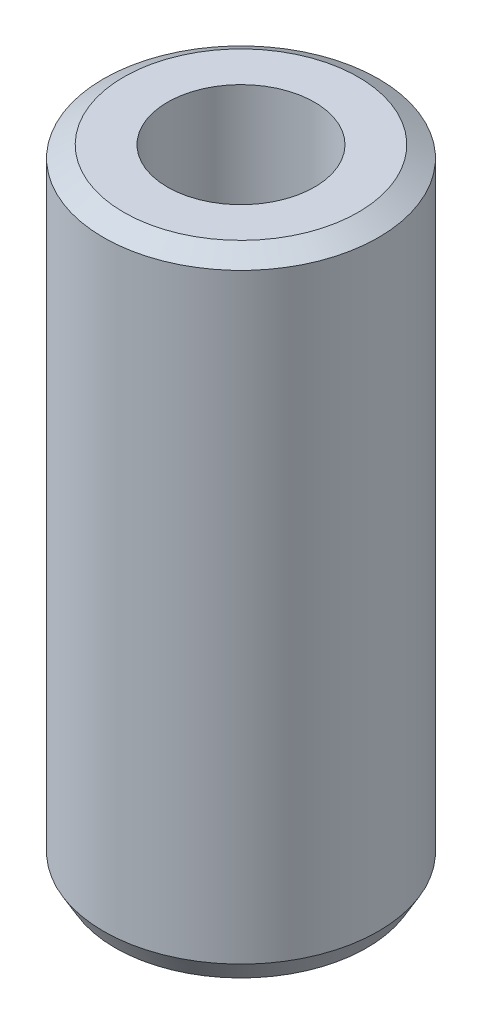
ISO-10303-21;
HEADER;
FILE_DESCRIPTION(('STEP AP214'),'2;1');
FILE_NAME('part.step','',(''),(''),'','','');
FILE_SCHEMA(('AUTOMOTIVE_DESIGN { 1 0 10303 214 1 1 1 1 }'));
ENDSEC;
DATA;
#1=APPLICATION_CONTEXT('core data for automotive mechanical design processes');
#2=APPLICATION_PROTOCOL_DEFINITION('international standard','automotive_design',2000,#1);
#3=PRODUCT_CONTEXT('',#1,'mechanical');
#4=PRODUCT('Part','Part','',(#3));
#5=PRODUCT_RELATED_PRODUCT_CATEGORY('part','',(#4));
#6=PRODUCT_DEFINITION_FORMATION('','',#4);
#7=PRODUCT_DEFINITION_CONTEXT('part definition',#1,'design');
#8=PRODUCT_DEFINITION('design','',#6,#7);
#9=PRODUCT_DEFINITION_SHAPE('','',#8);
#10=(LENGTH_UNIT() NAMED_UNIT(*) SI_UNIT(.MILLI.,.METRE.));
#11=(NAMED_UNIT(*) PLANE_ANGLE_UNIT() SI_UNIT($,.RADIAN.));
#12=(NAMED_UNIT(*) SI_UNIT($,.STERADIAN.) SOLID_ANGLE_UNIT());
#13=UNCERTAINTY_MEASURE_WITH_UNIT(LENGTH_MEASURE(1.E-05),#10,'distance_accuracy_value','');
#14=(GEOMETRIC_REPRESENTATION_CONTEXT(3) GLOBAL_UNCERTAINTY_ASSIGNED_CONTEXT((#13)) GLOBAL_UNIT_ASSIGNED_CONTEXT((#10,
#11,#12)) REPRESENTATION_CONTEXT('',''));
#15=CARTESIAN_POINT('',(0.,0.,0.));
#16=DIRECTION('',(0.,0.,1.));
#17=DIRECTION('',(1.,0.,0.));
#18=AXIS2_PLACEMENT_3D('',#15,#16,#17);
#19=CARTESIAN_POINT('',(0.,126.547188051281,0.));
#20=DIRECTION('',(0.,-1.,0.));
#21=DIRECTION('',(0.,0.,-1.));
#22=AXIS2_PLACEMENT_3D('',#19,#20,#21);
#23=CYLINDRICAL_SURFACE('',#22,27.5);
#24=CARTESIAN_POINT('',(0.,124.20850997424,0.));
#25=DIRECTION('',(0.,1.,0.));
#26=DIRECTION('',(0.,0.,1.));
#27=AXIS2_PLACEMENT_3D('',#24,#25,#26);
#28=CIRCLE('',#27,27.5);
#29=CARTESIAN_POINT('',(0.,124.20850997424,27.5));
#30=VERTEX_POINT('',#29);
#31=EDGE_CURVE('E50',#30,#30,#28,.F.);
#32=ORIENTED_EDGE('',*,*,#31,.T.);
#33=EDGE_LOOP('',(#32));
#34=FACE_BOUND('',#33,.T.);
#35=CARTESIAN_POINT('',(0.,4.05070925198237,0.));
#36=DIRECTION('',(0.,1.,0.));
#37=DIRECTION('',(0.,0.,1.));
#38=AXIS2_PLACEMENT_3D('',#35,#36,#37);
#39=CIRCLE('',#38,27.5);
#40=CARTESIAN_POINT('',(0.,4.05070925198237,27.5));
#41=VERTEX_POINT('',#40);
#42=EDGE_CURVE('E51',#41,#41,#39,.T.);
#43=ORIENTED_EDGE('',*,*,#42,.T.);
#44=EDGE_LOOP('',(#43));
#45=FACE_BOUND('',#44,.T.);
#46=ADVANCED_FACE('F39',(#34,#45),#23,.T.);
#47=CARTESIAN_POINT('',(0.,126.547188051281,0.));
#48=DIRECTION('',(0.,1.,0.));
#49=DIRECTION('',(0.,0.,1.));
#50=AXIS2_PLACEMENT_3D('',#47,#48,#49);
#51=PLANE('',#50);
#52=CARTESIAN_POINT('',(0.,126.547188051281,0.));
#53=DIRECTION('',(0.,1.,0.));
#54=DIRECTION('',(0.,0.,1.));
#55=AXIS2_PLACEMENT_3D('',#52,#53,#54);
#56=CIRCLE('',#55,23.4492907480176);
#57=CARTESIAN_POINT('',(0.,126.547188051281,23.4492907480176));
#58=VERTEX_POINT('',#57);
#59=EDGE_CURVE('E54',#58,#58,#56,.T.);
#60=ORIENTED_EDGE('',*,*,#59,.T.);
#61=EDGE_LOOP('',(#60));
#62=FACE_BOUND('',#61,.T.);
#63=CARTESIAN_POINT('',(0.,126.547188051281,0.));
#64=DIRECTION('',(0.,1.,0.));
#65=DIRECTION('',(0.,0.,1.));
#66=AXIS2_PLACEMENT_3D('',#63,#64,#65);
#67=CIRCLE('',#66,14.7146600426307);
#68=CARTESIAN_POINT('',(0.,126.547188051281,14.7146600426307));
#69=VERTEX_POINT('',#68);
#70=EDGE_CURVE('E58',#69,#69,#67,.T.);
#71=ORIENTED_EDGE('',*,*,#70,.F.);
#72=EDGE_LOOP('',(#71));
#73=FACE_BOUND('',#72,.T.);
#74=ADVANCED_FACE('F69',(#62,#73),#51,.T.);
#75=CARTESIAN_POINT('',(0.,0.,0.));
#76=DIRECTION('',(0.,1.,0.));
#77=DIRECTION('',(0.,0.,1.));
#78=AXIS2_PLACEMENT_3D('',#75,#76,#77);
#79=PLANE('',#78);
#80=CARTESIAN_POINT('',(0.,0.,0.));
#81=DIRECTION('',(0.,1.,0.));
#82=DIRECTION('',(0.,0.,1.));
#83=AXIS2_PLACEMENT_3D('',#80,#81,#82);
#84=CIRCLE('',#83,25.1613219229591);
#85=CARTESIAN_POINT('',(0.,0.,25.1613219229591));
#86=VERTEX_POINT('',#85);
#87=EDGE_CURVE('E10',#86,#86,#84,.F.);
#88=ORIENTED_EDGE('',*,*,#87,.T.);
#89=EDGE_LOOP('',(#88));
#90=FACE_BOUND('',#89,.T.);
#91=CARTESIAN_POINT('',(0.,0.,0.));
#92=DIRECTION('',(0.,1.,0.));
#93=DIRECTION('',(0.,0.,1.));
#94=AXIS2_PLACEMENT_3D('',#91,#92,#93);
#95=CIRCLE('',#94,14.7146600426307);
#96=CARTESIAN_POINT('',(0.,0.,14.7146600426307));
#97=VERTEX_POINT('',#96);
#98=EDGE_CURVE('E63',#97,#97,#95,.T.);
#99=ORIENTED_EDGE('',*,*,#98,.T.);
#100=EDGE_LOOP('',(#99));
#101=FACE_BOUND('',#100,.T.);
#102=ADVANCED_FACE('F75',(#90,#101),#79,.F.);
#103=CARTESIAN_POINT('',(0.,126.547188051281,0.));
#104=DIRECTION('',(0.,-1.,0.));
#105=DIRECTION('',(0.,0.,-1.));
#106=AXIS2_PLACEMENT_3D('',#103,#104,#105);
#107=CYLINDRICAL_SURFACE('',#106,14.7146600426307);
#108=ORIENTED_EDGE('',*,*,#70,.T.);
#109=EDGE_LOOP('',(#108));
#110=FACE_BOUND('',#109,.T.);
#111=ORIENTED_EDGE('',*,*,#98,.F.);
#112=EDGE_LOOP('',(#111));
#113=FACE_BOUND('',#112,.T.);
#114=ADVANCED_FACE('F70',(#110,#113),#107,.F.);
#115=CARTESIAN_POINT('',(0.,126.547188051281,0.));
#116=DIRECTION('',(0.,-1.,0.));
#117=DIRECTION('',(0.,0.,-1.));
#118=AXIS2_PLACEMENT_3D('',#115,#116,#117);
#119=CONICAL_SURFACE('',#118,23.4492907480176,1.0471975511966);
#120=ORIENTED_EDGE('',*,*,#31,.F.);
#121=EDGE_LOOP('',(#120));
#122=FACE_BOUND('',#121,.T.);
#123=ORIENTED_EDGE('',*,*,#59,.F.);
#124=EDGE_LOOP('',(#123));
#125=FACE_BOUND('',#124,.T.);
#126=ADVANCED_FACE('F81',(#122,#125),#119,.T.);
#127=CARTESIAN_POINT('',(0.,4.05070925198237,0.));
#128=DIRECTION('',(0.,1.,0.));
#129=DIRECTION('',(0.,0.,1.));
#130=AXIS2_PLACEMENT_3D('',#127,#128,#129);
#131=CONICAL_SURFACE('',#130,27.5,0.523598775598303);
#132=ORIENTED_EDGE('',*,*,#87,.F.);
#133=EDGE_LOOP('',(#132));
#134=FACE_BOUND('',#133,.T.);
#135=ORIENTED_EDGE('',*,*,#42,.F.);
#136=EDGE_LOOP('',(#135));
#137=FACE_BOUND('',#136,.T.);
#138=ADVANCED_FACE('F45',(#134,#137),#131,.T.);
#139=CLOSED_SHELL('',(#46,#74,#102,#114,#126,#138));
#140=MANIFOLD_SOLID_BREP('B2',#139);
#141=ADVANCED_BREP_SHAPE_REPRESENTATION('',(#18,#140),#14);
#142=SHAPE_DEFINITION_REPRESENTATION(#9,#141);
ENDSEC;
END-ISO-10303-21;
